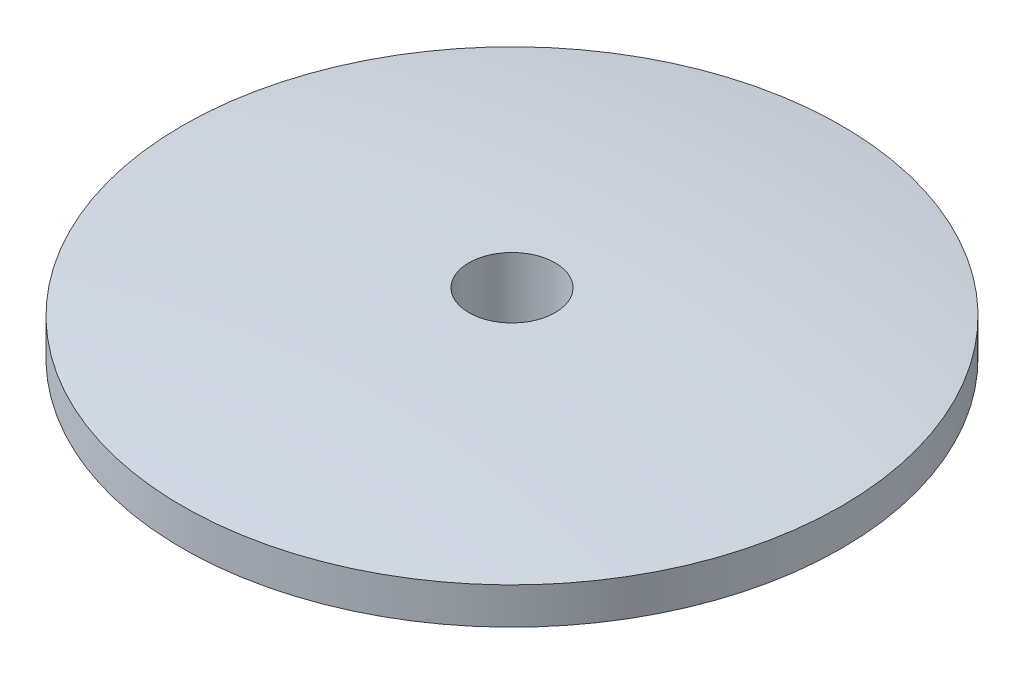
ISO-10303-21;
HEADER;
FILE_DESCRIPTION(('STEP AP214'),'2;1');
FILE_NAME('part.step','',(''),(''),'','','');
FILE_SCHEMA(('AUTOMOTIVE_DESIGN { 1 0 10303 214 1 1 1 1 }'));
ENDSEC;
DATA;
#1=APPLICATION_CONTEXT('core data for automotive mechanical design processes');
#2=APPLICATION_PROTOCOL_DEFINITION('international standard','automotive_design',2000,#1);
#3=PRODUCT_CONTEXT('',#1,'mechanical');
#4=PRODUCT('Part','Part','',(#3));
#5=PRODUCT_RELATED_PRODUCT_CATEGORY('part','',(#4));
#6=PRODUCT_DEFINITION_FORMATION('','',#4);
#7=PRODUCT_DEFINITION_CONTEXT('part definition',#1,'design');
#8=PRODUCT_DEFINITION('design','',#6,#7);
#9=PRODUCT_DEFINITION_SHAPE('','',#8);
#10=(LENGTH_UNIT() NAMED_UNIT(*) SI_UNIT(.MILLI.,.METRE.));
#11=(NAMED_UNIT(*) PLANE_ANGLE_UNIT() SI_UNIT($,.RADIAN.));
#12=(NAMED_UNIT(*) SI_UNIT($,.STERADIAN.) SOLID_ANGLE_UNIT());
#13=UNCERTAINTY_MEASURE_WITH_UNIT(LENGTH_MEASURE(1.E-05),#10,'distance_accuracy_value','');
#14=(GEOMETRIC_REPRESENTATION_CONTEXT(3) GLOBAL_UNCERTAINTY_ASSIGNED_CONTEXT((#13)) GLOBAL_UNIT_ASSIGNED_CONTEXT((#10,
#11,#12)) REPRESENTATION_CONTEXT('',''));
#15=CARTESIAN_POINT('',(0.,0.,0.));
#16=DIRECTION('',(0.,0.,1.));
#17=DIRECTION('',(1.,0.,0.));
#18=AXIS2_PLACEMENT_3D('',#15,#16,#17);
#19=CARTESIAN_POINT('',(0.,-5.23608796753936,0.));
#20=DIRECTION('',(0.,-1.,0.));
#21=DIRECTION('',(1.,0.,0.));
#22=AXIS2_PLACEMENT_3D('',#19,#20,#21);
#23=SPHERICAL_SURFACE('',#22,5.3861);
#24=CARTESIAN_POINT('',(0.,0.148978695000662,0.));
#25=DIRECTION('',(0.,-1.,0.));
#26=DIRECTION('',(1.,0.,0.));
#27=AXIS2_PLACEMENT_3D('',#24,#25,#26);
#28=CIRCLE('',#27,0.1055);
#29=CARTESIAN_POINT('',(0.105499999999999,0.148978695000663,0.));
#30=VERTEX_POINT('',#29);
#31=EDGE_CURVE('E10',#30,#30,#28,.T.);
#32=ORIENTED_EDGE('',*,*,#31,.T.);
#33=EDGE_LOOP('',(#32));
#34=FACE_BOUND('',#33,.T.);
#35=CARTESIAN_POINT('',(0.,0.0894999999999924,0.));
#36=DIRECTION('',(0.,-1.,0.));
#37=DIRECTION('',(1.,0.,0.));
#38=AXIS2_PLACEMENT_3D('',#35,#36,#37);
#39=CIRCLE('',#38,0.805100000000002);
#40=CARTESIAN_POINT('',(0.805100000000002,0.0894999999999952,0.));
#41=VERTEX_POINT('',#40);
#42=EDGE_CURVE('E47',#41,#41,#39,.T.);
#43=ORIENTED_EDGE('',*,*,#42,.F.);
#44=EDGE_LOOP('',(#43));
#45=FACE_BOUND('',#44,.T.);
#46=ADVANCED_FACE('F33',(#34,#45),#23,.T.);
#47=CARTESIAN_POINT('',(7.09965499951196E-13,-203.342200931378,0.));
#48=DIRECTION('',(0.,-1.,0.));
#49=DIRECTION('',(1.,0.,0.));
#50=AXIS2_PLACEMENT_3D('',#47,#48,#49);
#51=CYLINDRICAL_SURFACE('',#50,0.105499999997358);
#52=CARTESIAN_POINT('',(0.,0.,0.));
#53=DIRECTION('',(0.,-1.,0.));
#54=DIRECTION('',(1.,0.,0.));
#55=AXIS2_PLACEMENT_3D('',#52,#53,#54);
#56=CIRCLE('',#55,0.105499999994717);
#57=CARTESIAN_POINT('',(0.105499999994717,0.,0.));
#58=VERTEX_POINT('',#57);
#59=EDGE_CURVE('E39',#58,#58,#56,.T.);
#60=ORIENTED_EDGE('',*,*,#59,.T.);
#61=EDGE_LOOP('',(#60));
#62=FACE_BOUND('',#61,.T.);
#63=ORIENTED_EDGE('',*,*,#31,.F.);
#64=EDGE_LOOP('',(#63));
#65=FACE_BOUND('',#64,.T.);
#66=ADVANCED_FACE('F57',(#62,#65),#51,.F.);
#67=CARTESIAN_POINT('',(0.105499999994717,0.,0.));
#68=DIRECTION('',(0.,-1.,0.));
#69=DIRECTION('',(1.,0.,0.));
#70=AXIS2_PLACEMENT_3D('',#67,#68,#69);
#71=PLANE('',#70);
#72=CARTESIAN_POINT('',(0.,0.,0.));
#73=DIRECTION('',(0.,-1.,0.));
#74=DIRECTION('',(1.,0.,0.));
#75=AXIS2_PLACEMENT_3D('',#72,#73,#74);
#76=CIRCLE('',#75,0.805100000003999);
#77=CARTESIAN_POINT('',(0.805100000003999,0.,0.));
#78=VERTEX_POINT('',#77);
#79=EDGE_CURVE('E43',#78,#78,#76,.T.);
#80=ORIENTED_EDGE('',*,*,#79,.T.);
#81=EDGE_LOOP('',(#80));
#82=FACE_BOUND('',#81,.T.);
#83=ORIENTED_EDGE('',*,*,#59,.F.);
#84=EDGE_LOOP('',(#83));
#85=FACE_BOUND('',#84,.T.);
#86=ADVANCED_FACE('F61',(#82,#85),#71,.T.);
#87=CARTESIAN_POINT('',(7.09965499951196E-13,-203.342200931378,0.));
#88=DIRECTION('',(0.,-1.,0.));
#89=DIRECTION('',(1.,0.,0.));
#90=AXIS2_PLACEMENT_3D('',#87,#88,#89);
#91=CYLINDRICAL_SURFACE('',#90,0.805100000002001);
#92=ORIENTED_EDGE('',*,*,#42,.T.);
#93=EDGE_LOOP('',(#92));
#94=FACE_BOUND('',#93,.T.);
#95=ORIENTED_EDGE('',*,*,#79,.F.);
#96=EDGE_LOOP('',(#95));
#97=FACE_BOUND('',#96,.T.);
#98=ADVANCED_FACE('F53',(#94,#97),#91,.T.);
#99=CLOSED_SHELL('',(#46,#66,#86,#98));
#100=MANIFOLD_SOLID_BREP('B2',#99);
#101=ADVANCED_BREP_SHAPE_REPRESENTATION('',(#18,#100),#14);
#102=SHAPE_DEFINITION_REPRESENTATION(#9,#101);
ENDSEC;
END-ISO-10303-21;
